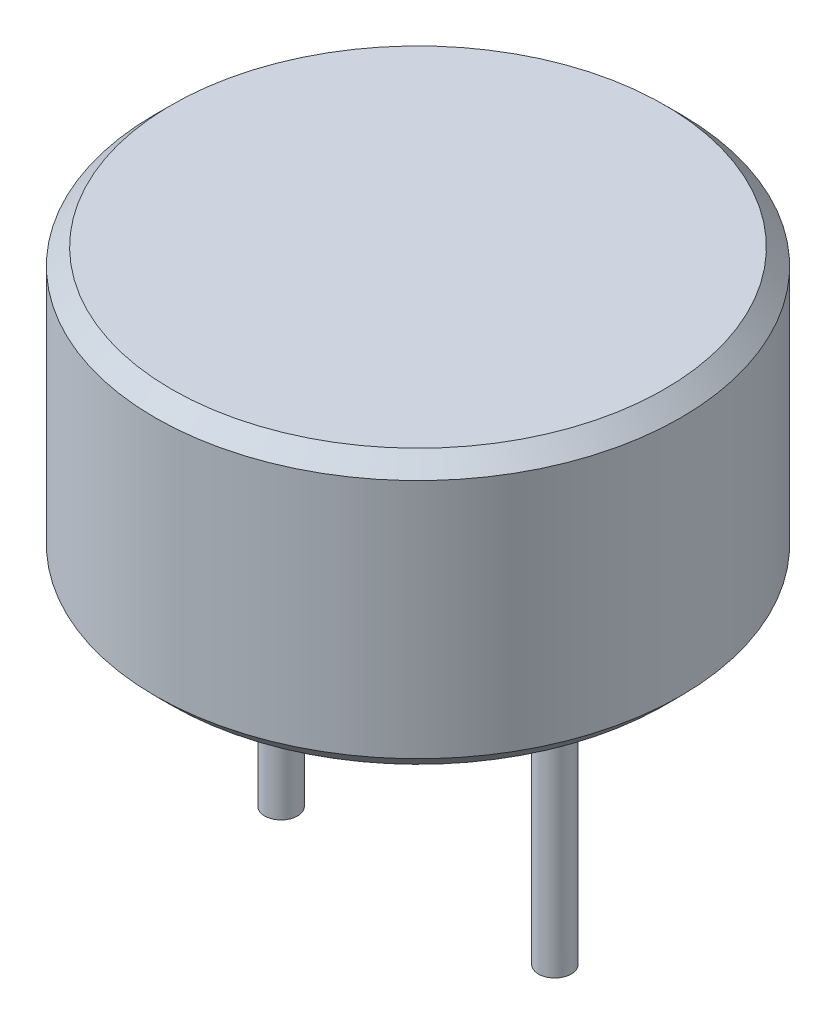
ISO-10303-21;
HEADER;
FILE_DESCRIPTION(('STEP AP214'),'2;1');
FILE_NAME('part.step','',(''),(''),'','','');
FILE_SCHEMA(('AUTOMOTIVE_DESIGN { 1 0 10303 214 1 1 1 1 }'));
ENDSEC;
DATA;
#1=APPLICATION_CONTEXT('core data for automotive mechanical design processes');
#2=APPLICATION_PROTOCOL_DEFINITION('international standard','automotive_design',2000,#1);
#3=PRODUCT_CONTEXT('',#1,'mechanical');
#4=PRODUCT('Part','Part','',(#3));
#5=PRODUCT_RELATED_PRODUCT_CATEGORY('part','',(#4));
#6=PRODUCT_DEFINITION_FORMATION('','',#4);
#7=PRODUCT_DEFINITION_CONTEXT('part definition',#1,'design');
#8=PRODUCT_DEFINITION('design','',#6,#7);
#9=PRODUCT_DEFINITION_SHAPE('','',#8);
#10=(LENGTH_UNIT() NAMED_UNIT(*) SI_UNIT(.MILLI.,.METRE.));
#11=(NAMED_UNIT(*) PLANE_ANGLE_UNIT() SI_UNIT($,.RADIAN.));
#12=(NAMED_UNIT(*) SI_UNIT($,.STERADIAN.) SOLID_ANGLE_UNIT());
#13=UNCERTAINTY_MEASURE_WITH_UNIT(LENGTH_MEASURE(1.E-05),#10,'distance_accuracy_value','');
#14=(GEOMETRIC_REPRESENTATION_CONTEXT(3) GLOBAL_UNCERTAINTY_ASSIGNED_CONTEXT((#13)) GLOBAL_UNIT_ASSIGNED_CONTEXT((#10,
#11,#12)) REPRESENTATION_CONTEXT('',''));
#15=CARTESIAN_POINT('',(0.,0.,0.));
#16=DIRECTION('',(0.,0.,1.));
#17=DIRECTION('',(1.,0.,0.));
#18=AXIS2_PLACEMENT_3D('',#15,#16,#17);
#19=CARTESIAN_POINT('',(0.,5.,0.));
#20=DIRECTION('',(0.,-1.,0.));
#21=DIRECTION('',(0.,0.,-1.));
#22=AXIS2_PLACEMENT_3D('',#19,#20,#21);
#23=CYLINDRICAL_SURFACE('',#22,4.8);
#24=CARTESIAN_POINT('',(0.,0.300000000000002,0.));
#25=DIRECTION('',(0.,1.,0.));
#26=DIRECTION('',(0.,0.,1.));
#27=AXIS2_PLACEMENT_3D('',#24,#25,#26);
#28=CIRCLE('',#27,4.8);
#29=CARTESIAN_POINT('',(0.,0.300000000000002,4.8));
#30=VERTEX_POINT('',#29);
#31=EDGE_CURVE('E56',#30,#30,#28,.T.);
#32=ORIENTED_EDGE('',*,*,#31,.T.);
#33=EDGE_LOOP('',(#32));
#34=FACE_BOUND('',#33,.T.);
#35=CARTESIAN_POINT('',(0.,4.7,0.));
#36=DIRECTION('',(0.,1.,0.));
#37=DIRECTION('',(0.,0.,1.));
#38=AXIS2_PLACEMENT_3D('',#35,#36,#37);
#39=CIRCLE('',#38,4.8);
#40=CARTESIAN_POINT('',(0.,4.7,4.8));
#41=VERTEX_POINT('',#40);
#42=EDGE_CURVE('E59',#41,#41,#39,.F.);
#43=ORIENTED_EDGE('',*,*,#42,.T.);
#44=EDGE_LOOP('',(#43));
#45=FACE_BOUND('',#44,.T.);
#46=ADVANCED_FACE('F35',(#34,#45),#23,.T.);
#47=CARTESIAN_POINT('',(0.,5.,0.));
#48=DIRECTION('',(0.,1.,0.));
#49=DIRECTION('',(0.,0.,1.));
#50=AXIS2_PLACEMENT_3D('',#47,#48,#49);
#51=PLANE('',#50);
#52=CARTESIAN_POINT('',(0.,5.,0.));
#53=DIRECTION('',(0.,1.,0.));
#54=DIRECTION('',(0.,0.,1.));
#55=AXIS2_PLACEMENT_3D('',#52,#53,#54);
#56=CIRCLE('',#55,4.5);
#57=CARTESIAN_POINT('',(0.,5.,4.5));
#58=VERTEX_POINT('',#57);
#59=EDGE_CURVE('E47',#58,#58,#56,.T.);
#60=ORIENTED_EDGE('',*,*,#59,.T.);
#61=EDGE_LOOP('',(#60));
#62=FACE_BOUND('',#61,.T.);
#63=ADVANCED_FACE('F84',(#62),#51,.T.);
#64=CARTESIAN_POINT('',(0.,0.,0.));
#65=DIRECTION('',(0.,1.,0.));
#66=DIRECTION('',(0.,0.,1.));
#67=AXIS2_PLACEMENT_3D('',#64,#65,#66);
#68=PLANE('',#67);
#69=CARTESIAN_POINT('',(2.5,0.,0.));
#70=DIRECTION('',(0.,1.,0.));
#71=DIRECTION('',(0.,0.,1.));
#72=AXIS2_PLACEMENT_3D('',#69,#70,#71);
#73=CIRCLE('',#72,0.3);
#74=CARTESIAN_POINT('',(2.5,0.,0.300000000000001));
#75=VERTEX_POINT('',#74);
#76=EDGE_CURVE('E10',#75,#75,#73,.F.);
#77=ORIENTED_EDGE('',*,*,#76,.F.);
#78=EDGE_LOOP('',(#77));
#79=FACE_BOUND('',#78,.T.);
#80=CARTESIAN_POINT('',(-2.5,0.,0.));
#81=DIRECTION('',(0.,1.,0.));
#82=DIRECTION('',(0.,0.,1.));
#83=AXIS2_PLACEMENT_3D('',#80,#81,#82);
#84=CIRCLE('',#83,0.3);
#85=CARTESIAN_POINT('',(-2.5,0.,0.3));
#86=VERTEX_POINT('',#85);
#87=EDGE_CURVE('E43',#86,#86,#84,.F.);
#88=ORIENTED_EDGE('',*,*,#87,.F.);
#89=EDGE_LOOP('',(#88));
#90=FACE_BOUND('',#89,.T.);
#91=CARTESIAN_POINT('',(0.,0.,0.));
#92=DIRECTION('',(0.,1.,0.));
#93=DIRECTION('',(0.,0.,1.));
#94=AXIS2_PLACEMENT_3D('',#91,#92,#93);
#95=CIRCLE('',#94,4.5);
#96=CARTESIAN_POINT('',(0.,0.,4.5));
#97=VERTEX_POINT('',#96);
#98=EDGE_CURVE('E51',#97,#97,#95,.F.);
#99=ORIENTED_EDGE('',*,*,#98,.T.);
#100=EDGE_LOOP('',(#99));
#101=FACE_BOUND('',#100,.T.);
#102=ADVANCED_FACE('F90',(#79,#90,#101),#68,.F.);
#103=CARTESIAN_POINT('',(0.,0.300000000000002,0.));
#104=DIRECTION('',(0.,1.,0.));
#105=DIRECTION('',(0.,0.,1.));
#106=AXIS2_PLACEMENT_3D('',#103,#104,#105);
#107=CONICAL_SURFACE('',#106,4.8,0.785398163397451);
#108=ORIENTED_EDGE('',*,*,#98,.F.);
#109=EDGE_LOOP('',(#108));
#110=FACE_BOUND('',#109,.T.);
#111=ORIENTED_EDGE('',*,*,#31,.F.);
#112=EDGE_LOOP('',(#111));
#113=FACE_BOUND('',#112,.T.);
#114=ADVANCED_FACE('F96',(#110,#113),#107,.T.);
#115=CARTESIAN_POINT('',(0.,5.,0.));
#116=DIRECTION('',(0.,-1.,0.));
#117=DIRECTION('',(0.,0.,-1.));
#118=AXIS2_PLACEMENT_3D('',#115,#116,#117);
#119=CONICAL_SURFACE('',#118,4.5,0.78539816339745);
#120=ORIENTED_EDGE('',*,*,#42,.F.);
#121=EDGE_LOOP('',(#120));
#122=FACE_BOUND('',#121,.T.);
#123=ORIENTED_EDGE('',*,*,#59,.F.);
#124=EDGE_LOOP('',(#123));
#125=FACE_BOUND('',#124,.T.);
#126=ADVANCED_FACE('F38',(#122,#125),#119,.T.);
#127=CARTESIAN_POINT('',(-2.5,-5.1,0.));
#128=DIRECTION('',(0.,1.,0.));
#129=DIRECTION('',(0.,0.,1.));
#130=AXIS2_PLACEMENT_3D('',#127,#128,#129);
#131=CYLINDRICAL_SURFACE('',#130,0.3);
#132=CARTESIAN_POINT('',(-2.5,-5.1,0.));
#133=DIRECTION('',(0.,-1.,0.));
#134=DIRECTION('',(0.,0.,-1.));
#135=AXIS2_PLACEMENT_3D('',#132,#133,#134);
#136=CIRCLE('',#135,0.3);
#137=CARTESIAN_POINT('',(-2.5,-5.1,-0.3));
#138=VERTEX_POINT('',#137);
#139=EDGE_CURVE('E62',#138,#138,#136,.T.);
#140=ORIENTED_EDGE('',*,*,#139,.F.);
#141=EDGE_LOOP('',(#140));
#142=FACE_BOUND('',#141,.T.);
#143=ORIENTED_EDGE('',*,*,#87,.T.);
#144=EDGE_LOOP('',(#143));
#145=FACE_BOUND('',#144,.T.);
#146=ADVANCED_FACE('F80',(#142,#145),#131,.T.);
#147=CARTESIAN_POINT('',(-2.5,-5.1,0.));
#148=DIRECTION('',(0.,-1.,0.));
#149=DIRECTION('',(0.,0.,-1.));
#150=AXIS2_PLACEMENT_3D('',#147,#148,#149);
#151=PLANE('',#150);
#152=ORIENTED_EDGE('',*,*,#139,.T.);
#153=EDGE_LOOP('',(#152));
#154=FACE_BOUND('',#153,.T.);
#155=ADVANCED_FACE('F73',(#154),#151,.T.);
#156=CARTESIAN_POINT('',(2.5,-5.1,0.));
#157=DIRECTION('',(0.,1.,0.));
#158=DIRECTION('',(0.,0.,1.));
#159=AXIS2_PLACEMENT_3D('',#156,#157,#158);
#160=CYLINDRICAL_SURFACE('',#159,0.3);
#161=CARTESIAN_POINT('',(2.5,-5.1,0.));
#162=DIRECTION('',(0.,-1.,0.));
#163=DIRECTION('',(0.,0.,-1.));
#164=AXIS2_PLACEMENT_3D('',#161,#162,#163);
#165=CIRCLE('',#164,0.3);
#166=CARTESIAN_POINT('',(2.5,-5.1,-0.299999999999999));
#167=VERTEX_POINT('',#166);
#168=EDGE_CURVE('E65',#167,#167,#165,.T.);
#169=ORIENTED_EDGE('',*,*,#168,.F.);
#170=EDGE_LOOP('',(#169));
#171=FACE_BOUND('',#170,.T.);
#172=ORIENTED_EDGE('',*,*,#76,.T.);
#173=EDGE_LOOP('',(#172));
#174=FACE_BOUND('',#173,.T.);
#175=ADVANCED_FACE('F71',(#171,#174),#160,.T.);
#176=CARTESIAN_POINT('',(2.5,-5.1,0.));
#177=DIRECTION('',(0.,-1.,0.));
#178=DIRECTION('',(0.,0.,-1.));
#179=AXIS2_PLACEMENT_3D('',#176,#177,#178);
#180=PLANE('',#179);
#181=ORIENTED_EDGE('',*,*,#168,.T.);
#182=EDGE_LOOP('',(#181));
#183=FACE_BOUND('',#182,.T.);
#184=ADVANCED_FACE('F69',(#183),#180,.T.);
#185=CLOSED_SHELL('',(#46,#63,#102,#114,#126,#146,#155,#175,#184));
#186=MANIFOLD_SOLID_BREP('B2',#185);
#187=ADVANCED_BREP_SHAPE_REPRESENTATION('',(#18,#186),#14);
#188=SHAPE_DEFINITION_REPRESENTATION(#9,#187);
ENDSEC;
END-ISO-10303-21;
